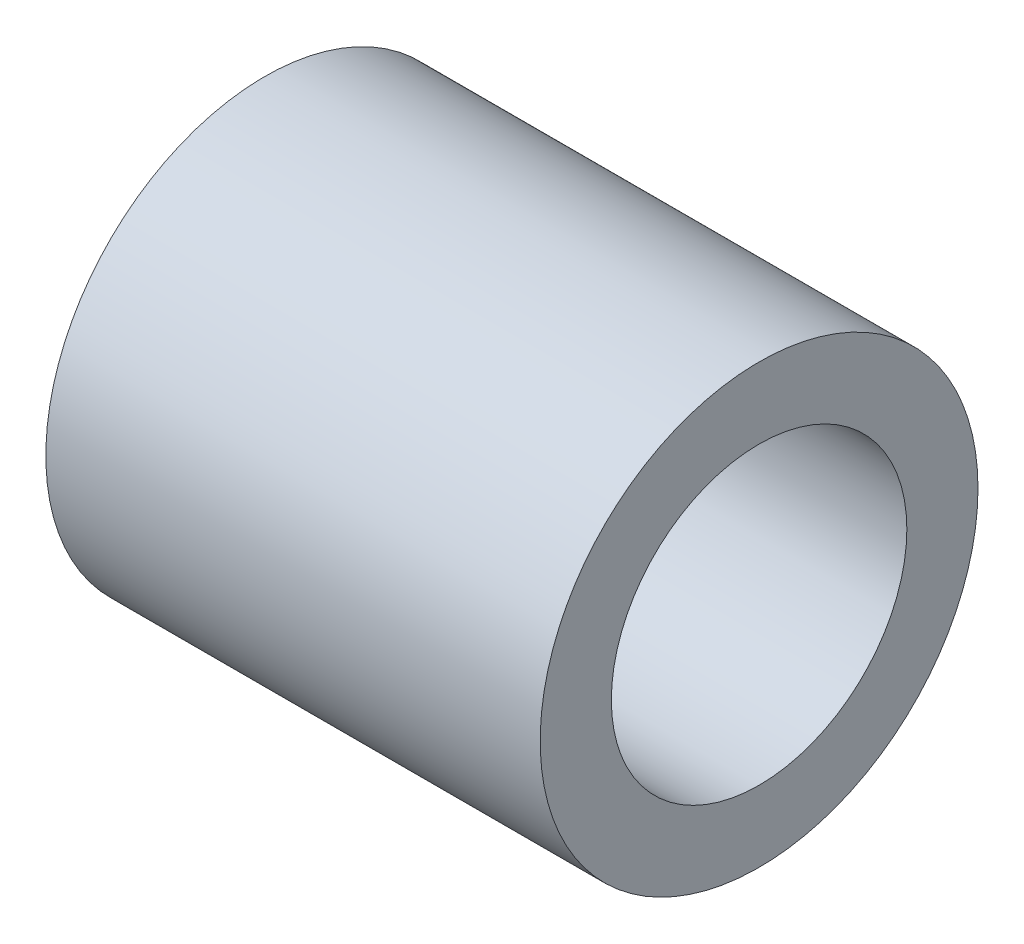
ISO-10303-21;
HEADER;
FILE_DESCRIPTION(('STEP AP214'),'2;1');
FILE_NAME('part.step','',(''),(''),'','','');
FILE_SCHEMA(('AUTOMOTIVE_DESIGN { 1 0 10303 214 1 1 1 1 }'));
ENDSEC;
DATA;
#1=APPLICATION_CONTEXT('core data for automotive mechanical design processes');
#2=APPLICATION_PROTOCOL_DEFINITION('international standard','automotive_design',2000,#1);
#3=PRODUCT_CONTEXT('',#1,'mechanical');
#4=PRODUCT('Part','Part','',(#3));
#5=PRODUCT_RELATED_PRODUCT_CATEGORY('part','',(#4));
#6=PRODUCT_DEFINITION_FORMATION('','',#4);
#7=PRODUCT_DEFINITION_CONTEXT('part definition',#1,'design');
#8=PRODUCT_DEFINITION('design','',#6,#7);
#9=PRODUCT_DEFINITION_SHAPE('','',#8);
#10=(LENGTH_UNIT() NAMED_UNIT(*) SI_UNIT(.MILLI.,.METRE.));
#11=(NAMED_UNIT(*) PLANE_ANGLE_UNIT() SI_UNIT($,.RADIAN.));
#12=(NAMED_UNIT(*) SI_UNIT($,.STERADIAN.) SOLID_ANGLE_UNIT());
#13=UNCERTAINTY_MEASURE_WITH_UNIT(LENGTH_MEASURE(1.E-05),#10,'distance_accuracy_value','');
#14=(GEOMETRIC_REPRESENTATION_CONTEXT(3) GLOBAL_UNCERTAINTY_ASSIGNED_CONTEXT((#13)) GLOBAL_UNIT_ASSIGNED_CONTEXT((#10,
#11,#12)) REPRESENTATION_CONTEXT('',''));
#15=CARTESIAN_POINT('',(0.,0.,0.));
#16=DIRECTION('',(0.,0.,1.));
#17=DIRECTION('',(1.,0.,0.));
#18=AXIS2_PLACEMENT_3D('',#15,#16,#17);
#19=CARTESIAN_POINT('',(13.55,0.,0.));
#20=DIRECTION('',(1.,0.,0.));
#21=DIRECTION('',(0.,0.,-1.));
#22=AXIS2_PLACEMENT_3D('',#19,#20,#21);
#23=PLANE('',#22);
#24=CARTESIAN_POINT('',(13.55,0.,0.));
#25=DIRECTION('',(1.,0.,0.));
#26=DIRECTION('',(0.,0.,-1.));
#27=AXIS2_PLACEMENT_3D('',#24,#25,#26);
#28=CIRCLE('',#27,6.);
#29=CARTESIAN_POINT('',(13.55,0.,-6.));
#30=VERTEX_POINT('',#29);
#31=EDGE_CURVE('E10',#30,#30,#28,.T.);
#32=ORIENTED_EDGE('',*,*,#31,.T.);
#33=EDGE_LOOP('',(#32));
#34=FACE_BOUND('',#33,.T.);
#35=CARTESIAN_POINT('',(13.55,0.,0.));
#36=DIRECTION('',(1.,0.,0.));
#37=DIRECTION('',(0.,0.,-1.));
#38=AXIS2_PLACEMENT_3D('',#35,#36,#37);
#39=CIRCLE('',#38,4.05);
#40=CARTESIAN_POINT('',(13.55,0.,-4.05));
#41=VERTEX_POINT('',#40);
#42=EDGE_CURVE('E48',#41,#41,#39,.T.);
#43=ORIENTED_EDGE('',*,*,#42,.F.);
#44=EDGE_LOOP('',(#43));
#45=FACE_BOUND('',#44,.T.);
#46=ADVANCED_FACE('F37',(#34,#45),#23,.T.);
#47=CARTESIAN_POINT('',(0.,0.,0.));
#48=DIRECTION('',(1.,0.,0.));
#49=DIRECTION('',(0.,0.,-1.));
#50=AXIS2_PLACEMENT_3D('',#47,#48,#49);
#51=PLANE('',#50);
#52=CARTESIAN_POINT('',(0.,0.,0.));
#53=DIRECTION('',(1.,0.,0.));
#54=DIRECTION('',(0.,0.,-1.));
#55=AXIS2_PLACEMENT_3D('',#52,#53,#54);
#56=CIRCLE('',#55,6.);
#57=CARTESIAN_POINT('',(0.,0.,-6.));
#58=VERTEX_POINT('',#57);
#59=EDGE_CURVE('E41',#58,#58,#56,.T.);
#60=ORIENTED_EDGE('',*,*,#59,.F.);
#61=EDGE_LOOP('',(#60));
#62=FACE_BOUND('',#61,.T.);
#63=CARTESIAN_POINT('',(0.,0.,0.));
#64=DIRECTION('',(1.,0.,0.));
#65=DIRECTION('',(0.,0.,-1.));
#66=AXIS2_PLACEMENT_3D('',#63,#64,#65);
#67=CIRCLE('',#66,4.05);
#68=CARTESIAN_POINT('',(0.,0.,-4.05));
#69=VERTEX_POINT('',#68);
#70=EDGE_CURVE('E50',#69,#69,#67,.T.);
#71=ORIENTED_EDGE('',*,*,#70,.T.);
#72=EDGE_LOOP('',(#71));
#73=FACE_BOUND('',#72,.T.);
#74=ADVANCED_FACE('F60',(#62,#73),#51,.F.);
#75=CARTESIAN_POINT('',(13.55,0.,0.));
#76=DIRECTION('',(-1.,0.,0.));
#77=DIRECTION('',(0.,0.,1.));
#78=AXIS2_PLACEMENT_3D('',#75,#76,#77);
#79=CYLINDRICAL_SURFACE('',#78,6.);
#80=ORIENTED_EDGE('',*,*,#31,.F.);
#81=EDGE_LOOP('',(#80));
#82=FACE_BOUND('',#81,.T.);
#83=ORIENTED_EDGE('',*,*,#59,.T.);
#84=EDGE_LOOP('',(#83));
#85=FACE_BOUND('',#84,.T.);
#86=ADVANCED_FACE('F39',(#82,#85),#79,.T.);
#87=CARTESIAN_POINT('',(13.55,0.,0.));
#88=DIRECTION('',(-1.,0.,0.));
#89=DIRECTION('',(0.,0.,1.));
#90=AXIS2_PLACEMENT_3D('',#87,#88,#89);
#91=CYLINDRICAL_SURFACE('',#90,4.05);
#92=ORIENTED_EDGE('',*,*,#42,.T.);
#93=EDGE_LOOP('',(#92));
#94=FACE_BOUND('',#93,.T.);
#95=ORIENTED_EDGE('',*,*,#70,.F.);
#96=EDGE_LOOP('',(#95));
#97=FACE_BOUND('',#96,.T.);
#98=ADVANCED_FACE('F56',(#94,#97),#91,.F.);
#99=CLOSED_SHELL('',(#46,#74,#86,#98));
#100=MANIFOLD_SOLID_BREP('B2',#99);
#101=ADVANCED_BREP_SHAPE_REPRESENTATION('',(#18,#100),#14);
#102=SHAPE_DEFINITION_REPRESENTATION(#9,#101);
ENDSEC;
END-ISO-10303-21;
